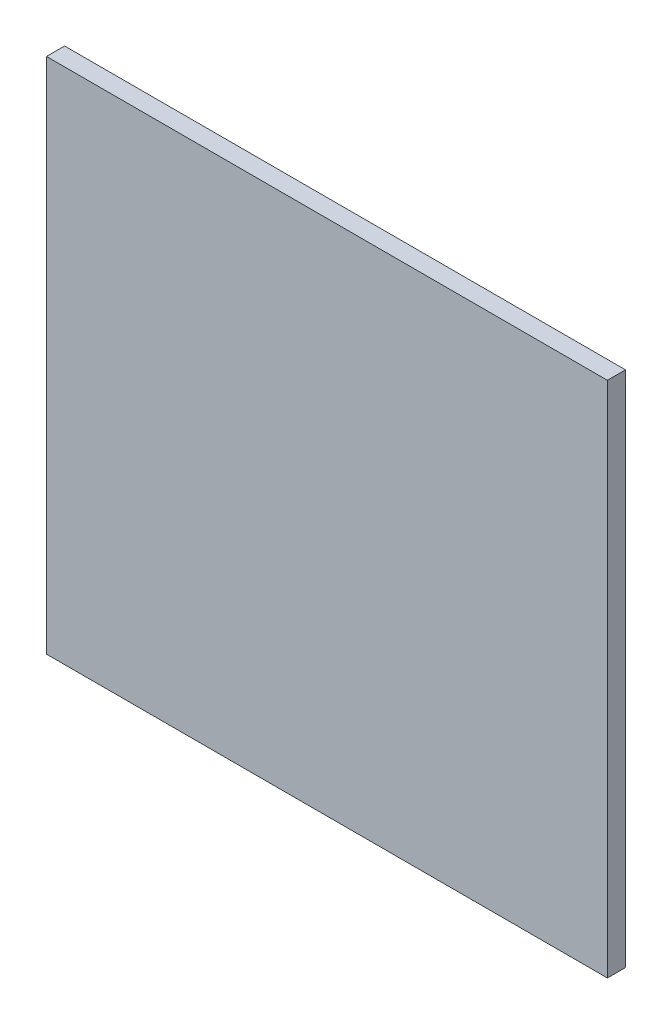
ISO-10303-21;
HEADER;
FILE_DESCRIPTION(('STEP AP214'),'2;1');
FILE_NAME('part.step','',(''),(''),'','','');
FILE_SCHEMA(('AUTOMOTIVE_DESIGN { 1 0 10303 214 1 1 1 1 }'));
ENDSEC;
DATA;
#1=APPLICATION_CONTEXT('core data for automotive mechanical design processes');
#2=APPLICATION_PROTOCOL_DEFINITION('international standard','automotive_design',2000,#1);
#3=PRODUCT_CONTEXT('',#1,'mechanical');
#4=PRODUCT('Part','Part','',(#3));
#5=PRODUCT_RELATED_PRODUCT_CATEGORY('part','',(#4));
#6=PRODUCT_DEFINITION_FORMATION('','',#4);
#7=PRODUCT_DEFINITION_CONTEXT('part definition',#1,'design');
#8=PRODUCT_DEFINITION('design','',#6,#7);
#9=PRODUCT_DEFINITION_SHAPE('','',#8);
#10=(LENGTH_UNIT() NAMED_UNIT(*) SI_UNIT(.MILLI.,.METRE.));
#11=(NAMED_UNIT(*) PLANE_ANGLE_UNIT() SI_UNIT($,.RADIAN.));
#12=(NAMED_UNIT(*) SI_UNIT($,.STERADIAN.) SOLID_ANGLE_UNIT());
#13=UNCERTAINTY_MEASURE_WITH_UNIT(LENGTH_MEASURE(1.E-05),#10,'distance_accuracy_value','');
#14=(GEOMETRIC_REPRESENTATION_CONTEXT(3) GLOBAL_UNCERTAINTY_ASSIGNED_CONTEXT((#13)) GLOBAL_UNIT_ASSIGNED_CONTEXT((#10,
#11,#12)) REPRESENTATION_CONTEXT('',''));
#15=CARTESIAN_POINT('',(0.,0.,0.));
#16=DIRECTION('',(0.,0.,1.));
#17=DIRECTION('',(1.,0.,0.));
#18=AXIS2_PLACEMENT_3D('',#15,#16,#17);
#19=CARTESIAN_POINT('',(-493.653597010277,-470.351475476519,18.));
#20=DIRECTION('',(1.,0.,0.));
#21=DIRECTION('',(0.,0.,-1.));
#22=AXIS2_PLACEMENT_3D('',#19,#20,#21);
#23=PLANE('',#22);
#24=DIRECTION('',(0.,-1.,0.));
#25=VECTOR('',#24,1.);
#26=CARTESIAN_POINT('',(-493.653597010277,-470.351475476519,0.));
#27=LINE('',#26,#25);
#28=CARTESIAN_POINT('',(-493.653597010277,44.6485245234811,0.));
#29=VERTEX_POINT('',#28);
#30=CARTESIAN_POINT('',(-493.653597010277,-470.351475476519,0.));
#31=VERTEX_POINT('',#30);
#32=EDGE_CURVE('E96',#29,#31,#27,.T.);
#33=ORIENTED_EDGE('',*,*,#32,.T.);
#34=DIRECTION('',(0.,0.,-1.));
#35=VECTOR('',#34,1.);
#36=CARTESIAN_POINT('',(-493.653597010277,-470.351475476519,18.));
#37=LINE('',#36,#35);
#38=CARTESIAN_POINT('',(-493.653597010277,-470.351475476519,18.));
#39=VERTEX_POINT('',#38);
#40=EDGE_CURVE('E11',#39,#31,#37,.T.);
#41=ORIENTED_EDGE('',*,*,#40,.F.);
#42=DIRECTION('',(0.,-1.,0.));
#43=VECTOR('',#42,1.);
#44=CARTESIAN_POINT('',(-493.653597010277,-470.351475476519,18.));
#45=LINE('',#44,#43);
#46=CARTESIAN_POINT('',(-493.653597010277,44.6485245234811,18.));
#47=VERTEX_POINT('',#46);
#48=EDGE_CURVE('E84',#47,#39,#45,.T.);
#49=ORIENTED_EDGE('',*,*,#48,.F.);
#50=DIRECTION('',(0.,0.,-1.));
#51=VECTOR('',#50,1.);
#52=CARTESIAN_POINT('',(-493.653597010277,44.6485245234811,18.));
#53=LINE('',#52,#51);
#54=EDGE_CURVE('E92',#47,#29,#53,.T.);
#55=ORIENTED_EDGE('',*,*,#54,.T.);
#56=EDGE_LOOP('',(#33,#41,#49,#55));
#57=FACE_BOUND('',#56,.T.);
#58=ADVANCED_FACE('F33',(#57),#23,.F.);
#59=CARTESIAN_POINT('',(64.3464029897229,-470.351475476519,18.));
#60=DIRECTION('',(0.,1.,0.));
#61=DIRECTION('',(-1.,0.,0.));
#62=AXIS2_PLACEMENT_3D('',#59,#60,#61);
#63=PLANE('',#62);
#64=DIRECTION('',(1.,0.,0.));
#65=VECTOR('',#64,1.);
#66=CARTESIAN_POINT('',(64.3464029897229,-470.351475476519,0.));
#67=LINE('',#66,#65);
#68=CARTESIAN_POINT('',(64.3464029897229,-470.351475476519,0.));
#69=VERTEX_POINT('',#68);
#70=EDGE_CURVE('E88',#31,#69,#67,.T.);
#71=ORIENTED_EDGE('',*,*,#70,.T.);
#72=DIRECTION('',(0.,0.,-1.));
#73=VECTOR('',#72,1.);
#74=CARTESIAN_POINT('',(64.3464029897229,-470.351475476519,18.));
#75=LINE('',#74,#73);
#76=CARTESIAN_POINT('',(64.3464029897229,-470.351475476519,18.));
#77=VERTEX_POINT('',#76);
#78=EDGE_CURVE('E41',#77,#69,#75,.T.);
#79=ORIENTED_EDGE('',*,*,#78,.F.);
#80=DIRECTION('',(1.,0.,0.));
#81=VECTOR('',#80,1.);
#82=CARTESIAN_POINT('',(64.3464029897229,-470.351475476519,18.));
#83=LINE('',#82,#81);
#84=EDGE_CURVE('E79',#39,#77,#83,.T.);
#85=ORIENTED_EDGE('',*,*,#84,.F.);
#86=ORIENTED_EDGE('',*,*,#40,.T.);
#87=EDGE_LOOP('',(#71,#79,#85,#86));
#88=FACE_BOUND('',#87,.T.);
#89=ADVANCED_FACE('F87',(#88),#63,.F.);
#90=CARTESIAN_POINT('',(64.3464029897229,-470.351475476519,18.));
#91=DIRECTION('',(-1.,0.,0.));
#92=DIRECTION('',(0.,0.,1.));
#93=AXIS2_PLACEMENT_3D('',#90,#91,#92);
#94=PLANE('',#93);
#95=DIRECTION('',(0.,1.,0.));
#96=VECTOR('',#95,1.);
#97=CARTESIAN_POINT('',(64.3464029897229,-470.351475476519,0.));
#98=LINE('',#97,#96);
#99=CARTESIAN_POINT('',(64.3464029897229,44.6485245234812,0.));
#100=VERTEX_POINT('',#99);
#101=EDGE_CURVE('E66',#69,#100,#98,.T.);
#102=ORIENTED_EDGE('',*,*,#101,.T.);
#103=DIRECTION('',(0.,0.,-1.));
#104=VECTOR('',#103,1.);
#105=CARTESIAN_POINT('',(64.3464029897229,44.6485245234812,18.));
#106=LINE('',#105,#104);
#107=CARTESIAN_POINT('',(64.3464029897229,44.6485245234812,18.));
#108=VERTEX_POINT('',#107);
#109=EDGE_CURVE('E89',#108,#100,#106,.T.);
#110=ORIENTED_EDGE('',*,*,#109,.F.);
#111=DIRECTION('',(0.,1.,0.));
#112=VECTOR('',#111,1.);
#113=CARTESIAN_POINT('',(64.3464029897229,-470.351475476519,18.));
#114=LINE('',#113,#112);
#115=EDGE_CURVE('E82',#77,#108,#114,.T.);
#116=ORIENTED_EDGE('',*,*,#115,.F.);
#117=ORIENTED_EDGE('',*,*,#78,.T.);
#118=EDGE_LOOP('',(#102,#110,#116,#117));
#119=FACE_BOUND('',#118,.T.);
#120=ADVANCED_FACE('F90',(#119),#94,.F.);
#121=CARTESIAN_POINT('',(64.3464029897229,44.6485245234812,18.));
#122=DIRECTION('',(0.,-1.,0.));
#123=DIRECTION('',(1.,0.,0.));
#124=AXIS2_PLACEMENT_3D('',#121,#122,#123);
#125=PLANE('',#124);
#126=DIRECTION('',(-1.,0.,0.));
#127=VECTOR('',#126,1.);
#128=CARTESIAN_POINT('',(64.3464029897229,44.6485245234812,0.));
#129=LINE('',#128,#127);
#130=EDGE_CURVE('E72',#100,#29,#129,.T.);
#131=ORIENTED_EDGE('',*,*,#130,.T.);
#132=ORIENTED_EDGE('',*,*,#54,.F.);
#133=DIRECTION('',(-1.,0.,0.));
#134=VECTOR('',#133,1.);
#135=CARTESIAN_POINT('',(64.3464029897229,44.6485245234812,18.));
#136=LINE('',#135,#134);
#137=EDGE_CURVE('E49',#108,#47,#136,.T.);
#138=ORIENTED_EDGE('',*,*,#137,.F.);
#139=ORIENTED_EDGE('',*,*,#109,.T.);
#140=EDGE_LOOP('',(#131,#132,#138,#139));
#141=FACE_BOUND('',#140,.T.);
#142=ADVANCED_FACE('F103',(#141),#125,.F.);
#143=CARTESIAN_POINT('',(0.,0.,18.));
#144=DIRECTION('',(0.,0.,1.));
#145=DIRECTION('',(1.,0.,0.));
#146=AXIS2_PLACEMENT_3D('',#143,#144,#145);
#147=PLANE('',#146);
#148=ORIENTED_EDGE('',*,*,#48,.T.);
#149=ORIENTED_EDGE('',*,*,#84,.T.);
#150=ORIENTED_EDGE('',*,*,#115,.T.);
#151=ORIENTED_EDGE('',*,*,#137,.T.);
#152=EDGE_LOOP('',(#148,#149,#150,#151));
#153=FACE_BOUND('',#152,.T.);
#154=ADVANCED_FACE('F80',(#153),#147,.T.);
#155=CARTESIAN_POINT('',(0.,0.,0.));
#156=DIRECTION('',(0.,0.,1.));
#157=DIRECTION('',(1.,0.,0.));
#158=AXIS2_PLACEMENT_3D('',#155,#156,#157);
#159=PLANE('',#158);
#160=ORIENTED_EDGE('',*,*,#32,.F.);
#161=ORIENTED_EDGE('',*,*,#130,.F.);
#162=ORIENTED_EDGE('',*,*,#101,.F.);
#163=ORIENTED_EDGE('',*,*,#70,.F.);
#164=EDGE_LOOP('',(#160,#161,#162,#163));
#165=FACE_BOUND('',#164,.T.);
#166=ADVANCED_FACE('F106',(#165),#159,.F.);
#167=CLOSED_SHELL('',(#58,#89,#120,#142,#154,#166));
#168=MANIFOLD_SOLID_BREP('B2',#167);
#169=ADVANCED_BREP_SHAPE_REPRESENTATION('',(#18,#168),#14);
#170=SHAPE_DEFINITION_REPRESENTATION(#9,#169);
ENDSEC;
END-ISO-10303-21;
